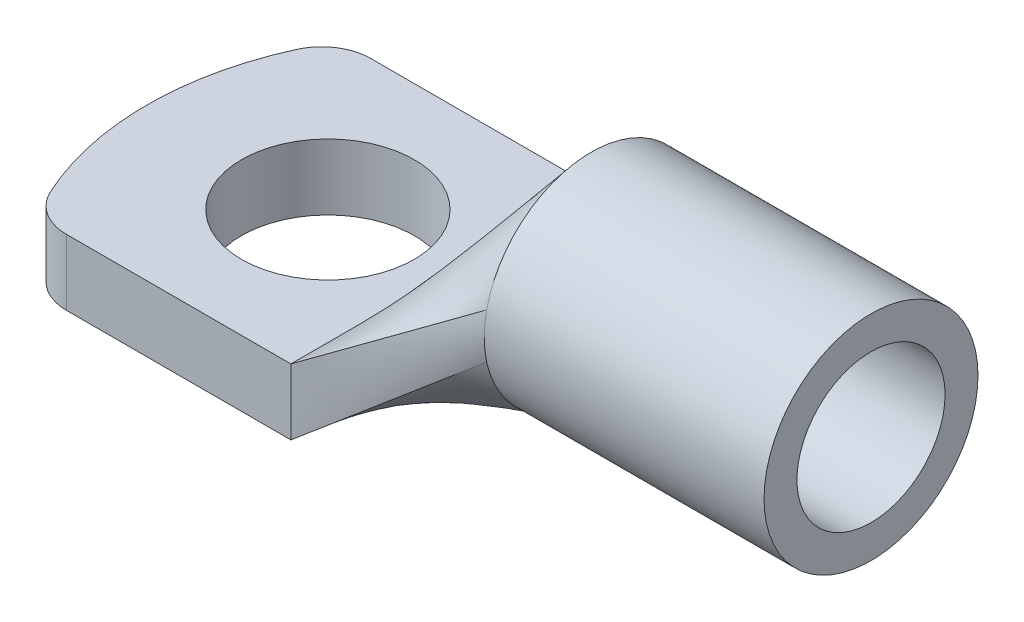
ISO-10303-21;
HEADER;
FILE_DESCRIPTION(('STEP AP214'),'2;1');
FILE_NAME('part.step','',(''),(''),'','','');
FILE_SCHEMA(('AUTOMOTIVE_DESIGN { 1 0 10303 214 1 1 1 1 }'));
ENDSEC;
DATA;
#1=APPLICATION_CONTEXT('core data for automotive mechanical design processes');
#2=APPLICATION_PROTOCOL_DEFINITION('international standard','automotive_design',2000,#1);
#3=PRODUCT_CONTEXT('',#1,'mechanical');
#4=PRODUCT('Part','Part','',(#3));
#5=PRODUCT_RELATED_PRODUCT_CATEGORY('part','',(#4));
#6=PRODUCT_DEFINITION_FORMATION('','',#4);
#7=PRODUCT_DEFINITION_CONTEXT('part definition',#1,'design');
#8=PRODUCT_DEFINITION('design','',#6,#7);
#9=PRODUCT_DEFINITION_SHAPE('','',#8);
#10=(LENGTH_UNIT() NAMED_UNIT(*) SI_UNIT(.MILLI.,.METRE.));
#11=(NAMED_UNIT(*) PLANE_ANGLE_UNIT() SI_UNIT($,.RADIAN.));
#12=(NAMED_UNIT(*) SI_UNIT($,.STERADIAN.) SOLID_ANGLE_UNIT());
#13=UNCERTAINTY_MEASURE_WITH_UNIT(LENGTH_MEASURE(1.E-05),#10,'distance_accuracy_value','');
#14=(GEOMETRIC_REPRESENTATION_CONTEXT(3) GLOBAL_UNCERTAINTY_ASSIGNED_CONTEXT((#13)) GLOBAL_UNIT_ASSIGNED_CONTEXT((#10,
#11,#12)) REPRESENTATION_CONTEXT('',''));
#15=CARTESIAN_POINT('',(0.,0.,0.));
#16=DIRECTION('',(0.,0.,1.));
#17=DIRECTION('',(1.,0.,0.));
#18=AXIS2_PLACEMENT_3D('',#15,#16,#17);
#19=CARTESIAN_POINT('',(0.,4.,-9.25));
#20=DIRECTION('',(0.,0.,-1.));
#21=DIRECTION('',(-1.,0.,0.));
#22=AXIS2_PLACEMENT_3D('',#19,#20,#21);
#23=PLANE('',#22);
#24=DIRECTION('',(1.,0.,0.));
#25=VECTOR('',#24,1.);
#26=CARTESIAN_POINT('',(0.,0.,-9.25));
#27=LINE('',#26,#25);
#28=CARTESIAN_POINT('',(-4.63589014329465,0.,-9.25));
#29=VERTEX_POINT('',#28);
#30=CARTESIAN_POINT('',(9.,0.,-9.25));
#31=VERTEX_POINT('',#30);
#32=EDGE_CURVE('E182',#29,#31,#27,.T.);
#33=ORIENTED_EDGE('',*,*,#32,.F.);
#34=DIRECTION('',(0.,1.,0.));
#35=VECTOR('',#34,1.);
#36=CARTESIAN_POINT('',(-4.63589014329465,4.,-9.25));
#37=LINE('',#36,#35);
#38=CARTESIAN_POINT('',(-4.63589014329465,4.,-9.25));
#39=VERTEX_POINT('',#38);
#40=EDGE_CURVE('E344',#29,#39,#37,.T.);
#41=ORIENTED_EDGE('',*,*,#40,.T.);
#42=DIRECTION('',(1.,0.,0.));
#43=VECTOR('',#42,1.);
#44=CARTESIAN_POINT('',(0.,4.,-9.25));
#45=LINE('',#44,#43);
#46=CARTESIAN_POINT('',(9.,4.,-9.25));
#47=VERTEX_POINT('',#46);
#48=EDGE_CURVE('E189',#39,#47,#45,.T.);
#49=ORIENTED_EDGE('',*,*,#48,.T.);
#50=DIRECTION('',(0.,1.,0.));
#51=VECTOR('',#50,1.);
#52=CARTESIAN_POINT('',(9.,4.,-9.25));
#53=LINE('',#52,#51);
#54=EDGE_CURVE('E195',#47,#31,#53,.F.);
#55=ORIENTED_EDGE('',*,*,#54,.T.);
#56=EDGE_LOOP('',(#33,#41,#49,#55));
#57=FACE_BOUND('',#56,.T.);
#58=ADVANCED_FACE('F84',(#57),#23,.T.);
#59=CARTESIAN_POINT('',(9.,4.,0.));
#60=DIRECTION('',(0.,-1.,0.));
#61=DIRECTION('',(0.,0.,-1.));
#62=AXIS2_PLACEMENT_3D('',#59,#60,#61);
#63=CYLINDRICAL_SURFACE('',#62,18.);
#64=CARTESIAN_POINT('',(9.,4.,0.));
#65=DIRECTION('',(0.,1.,0.));
#66=DIRECTION('',(0.,0.,1.));
#67=AXIS2_PLACEMENT_3D('',#64,#65,#66);
#68=CIRCLE('',#67,18.);
#69=CARTESIAN_POINT('',(-7.36306817195357,4.,-7.5));
#70=VERTEX_POINT('',#69);
#71=CARTESIAN_POINT('',(-7.36306817195357,4.,7.5));
#72=VERTEX_POINT('',#71);
#73=EDGE_CURVE('E188',#70,#72,#68,.T.);
#74=ORIENTED_EDGE('',*,*,#73,.F.);
#75=DIRECTION('',(0.,-1.,0.));
#76=VECTOR('',#75,1.);
#77=CARTESIAN_POINT('',(-7.36306817195358,4.,-7.5));
#78=LINE('',#77,#76);
#79=CARTESIAN_POINT('',(-7.36306817195357,0.,-7.5));
#80=VERTEX_POINT('',#79);
#81=EDGE_CURVE('E167',#70,#80,#78,.T.);
#82=ORIENTED_EDGE('',*,*,#81,.T.);
#83=CARTESIAN_POINT('',(9.,0.,0.));
#84=DIRECTION('',(0.,1.,0.));
#85=DIRECTION('',(0.,0.,1.));
#86=AXIS2_PLACEMENT_3D('',#83,#84,#85);
#87=CIRCLE('',#86,18.);
#88=CARTESIAN_POINT('',(-7.36306817195357,0.,7.5));
#89=VERTEX_POINT('',#88);
#90=EDGE_CURVE('E178',#80,#89,#87,.T.);
#91=ORIENTED_EDGE('',*,*,#90,.T.);
#92=DIRECTION('',(0.,-1.,0.));
#93=VECTOR('',#92,1.);
#94=CARTESIAN_POINT('',(-7.36306817195358,4.,7.5));
#95=LINE('',#94,#93);
#96=EDGE_CURVE('E163',#89,#72,#95,.F.);
#97=ORIENTED_EDGE('',*,*,#96,.T.);
#98=EDGE_LOOP('',(#74,#82,#91,#97));
#99=FACE_BOUND('',#98,.T.);
#100=ADVANCED_FACE('F353',(#99),#63,.T.);
#101=CARTESIAN_POINT('',(0.,4.,9.25));
#102=DIRECTION('',(0.,0.,-1.));
#103=DIRECTION('',(-1.,0.,0.));
#104=AXIS2_PLACEMENT_3D('',#101,#102,#103);
#105=PLANE('',#104);
#106=DIRECTION('',(1.,0.,0.));
#107=VECTOR('',#106,1.);
#108=CARTESIAN_POINT('',(0.,4.,9.25));
#109=LINE('',#108,#107);
#110=CARTESIAN_POINT('',(-4.63589014329465,4.,9.25));
#111=VERTEX_POINT('',#110);
#112=CARTESIAN_POINT('',(9.,4.,9.25));
#113=VERTEX_POINT('',#112);
#114=EDGE_CURVE('E174',#111,#113,#109,.T.);
#115=ORIENTED_EDGE('',*,*,#114,.F.);
#116=DIRECTION('',(0.,-1.,0.));
#117=VECTOR('',#116,1.);
#118=CARTESIAN_POINT('',(-4.63589014329465,4.,9.25));
#119=LINE('',#118,#117);
#120=CARTESIAN_POINT('',(-4.63589014329465,0.,9.25));
#121=VERTEX_POINT('',#120);
#122=EDGE_CURVE('E95',#111,#121,#119,.T.);
#123=ORIENTED_EDGE('',*,*,#122,.T.);
#124=DIRECTION('',(1.,0.,0.));
#125=VECTOR('',#124,1.);
#126=CARTESIAN_POINT('',(0.,0.,9.25));
#127=LINE('',#126,#125);
#128=CARTESIAN_POINT('',(9.,0.,9.25));
#129=VERTEX_POINT('',#128);
#130=EDGE_CURVE('E172',#121,#129,#127,.T.);
#131=ORIENTED_EDGE('',*,*,#130,.T.);
#132=DIRECTION('',(0.,1.,0.));
#133=VECTOR('',#132,1.);
#134=CARTESIAN_POINT('',(9.,4.,9.25));
#135=LINE('',#134,#133);
#136=EDGE_CURVE('E193',#113,#129,#135,.F.);
#137=ORIENTED_EDGE('',*,*,#136,.F.);
#138=EDGE_LOOP('',(#115,#123,#131,#137));
#139=FACE_BOUND('',#138,.T.);
#140=ADVANCED_FACE('F170',(#139),#105,.F.);
#141=CARTESIAN_POINT('',(2.,4.,0.));
#142=DIRECTION('',(0.,-1.,0.));
#143=DIRECTION('',(0.,0.,-1.));
#144=AXIS2_PLACEMENT_3D('',#141,#142,#143);
#145=CYLINDRICAL_SURFACE('',#144,5.25);
#146=CARTESIAN_POINT('',(2.,4.,0.));
#147=DIRECTION('',(0.,1.,0.));
#148=DIRECTION('',(0.,0.,1.));
#149=AXIS2_PLACEMENT_3D('',#146,#147,#148);
#150=CIRCLE('',#149,5.25);
#151=CARTESIAN_POINT('',(2.,4.,5.25000000000001));
#152=VERTEX_POINT('',#151);
#153=EDGE_CURVE('E180',#152,#152,#150,.T.);
#154=ORIENTED_EDGE('',*,*,#153,.T.);
#155=EDGE_LOOP('',(#154));
#156=FACE_BOUND('',#155,.T.);
#157=CARTESIAN_POINT('',(2.,0.,0.));
#158=DIRECTION('',(0.,1.,0.));
#159=DIRECTION('',(0.,0.,1.));
#160=AXIS2_PLACEMENT_3D('',#157,#158,#159);
#161=CIRCLE('',#160,5.25);
#162=CARTESIAN_POINT('',(2.,0.,5.25000000000001));
#163=VERTEX_POINT('',#162);
#164=EDGE_CURVE('E192',#163,#163,#161,.T.);
#165=ORIENTED_EDGE('',*,*,#164,.F.);
#166=EDGE_LOOP('',(#165));
#167=FACE_BOUND('',#166,.T.);
#168=ADVANCED_FACE('F372',(#156,#167),#145,.F.);
#169=CARTESIAN_POINT('',(0.,4.,0.));
#170=DIRECTION('',(0.,1.,0.));
#171=DIRECTION('',(0.,0.,1.));
#172=AXIS2_PLACEMENT_3D('',#169,#170,#171);
#173=PLANE('',#172);
#174=ORIENTED_EDGE('',*,*,#153,.F.);
#175=EDGE_LOOP('',(#174));
#176=FACE_BOUND('',#175,.T.);
#177=ORIENTED_EDGE('',*,*,#48,.F.);
#178=CARTESIAN_POINT('',(-4.63589014329465,4.,-6.25));
#179=DIRECTION('',(0.,1.,0.));
#180=DIRECTION('',(0.,0.,1.));
#181=AXIS2_PLACEMENT_3D('',#178,#179,#180);
#182=CIRCLE('',#181,3.);
#183=EDGE_CURVE('E175',#39,#70,#182,.T.);
#184=ORIENTED_EDGE('',*,*,#183,.T.);
#185=ORIENTED_EDGE('',*,*,#73,.T.);
#186=CARTESIAN_POINT('',(-4.63589014329465,4.,6.25));
#187=DIRECTION('',(0.,1.,0.));
#188=DIRECTION('',(0.,0.,1.));
#189=AXIS2_PLACEMENT_3D('',#186,#187,#188);
#190=CIRCLE('',#189,3.);
#191=EDGE_CURVE('E104',#72,#111,#190,.T.);
#192=ORIENTED_EDGE('',*,*,#191,.T.);
#193=ORIENTED_EDGE('',*,*,#114,.T.);
#194=DIRECTION('',(0.,0.,1.));
#195=VECTOR('',#194,1.);
#196=CARTESIAN_POINT('',(9.,4.,0.));
#197=LINE('',#196,#195);
#198=EDGE_CURVE('E187',#113,#47,#197,.F.);
#199=ORIENTED_EDGE('',*,*,#198,.T.);
#200=EDGE_LOOP('',(#177,#184,#185,#192,#193,#199));
#201=FACE_BOUND('',#200,.T.);
#202=ADVANCED_FACE('F339',(#176,#201),#173,.T.);
#203=CARTESIAN_POINT('',(0.,0.,0.));
#204=DIRECTION('',(0.,1.,0.));
#205=DIRECTION('',(0.,0.,1.));
#206=AXIS2_PLACEMENT_3D('',#203,#204,#205);
#207=PLANE('',#206);
#208=ORIENTED_EDGE('',*,*,#164,.T.);
#209=EDGE_LOOP('',(#208));
#210=FACE_BOUND('',#209,.T.);
#211=ORIENTED_EDGE('',*,*,#90,.F.);
#212=CARTESIAN_POINT('',(-4.63589014329465,0.,-6.25));
#213=DIRECTION('',(0.,1.,0.));
#214=DIRECTION('',(0.,0.,1.));
#215=AXIS2_PLACEMENT_3D('',#212,#213,#214);
#216=CIRCLE('',#215,3.);
#217=EDGE_CURVE('E166',#80,#29,#216,.F.);
#218=ORIENTED_EDGE('',*,*,#217,.T.);
#219=ORIENTED_EDGE('',*,*,#32,.T.);
#220=DIRECTION('',(0.,0.,1.));
#221=VECTOR('',#220,1.);
#222=CARTESIAN_POINT('',(9.,0.,0.));
#223=LINE('',#222,#221);
#224=EDGE_CURVE('E124',#129,#31,#223,.F.);
#225=ORIENTED_EDGE('',*,*,#224,.F.);
#226=ORIENTED_EDGE('',*,*,#130,.F.);
#227=CARTESIAN_POINT('',(-4.63589014329465,0.,6.25));
#228=DIRECTION('',(0.,1.,0.));
#229=DIRECTION('',(0.,0.,1.));
#230=AXIS2_PLACEMENT_3D('',#227,#228,#229);
#231=CIRCLE('',#230,3.);
#232=EDGE_CURVE('E161',#121,#89,#231,.F.);
#233=ORIENTED_EDGE('',*,*,#232,.T.);
#234=EDGE_LOOP('',(#211,#218,#219,#225,#226,#233));
#235=FACE_BOUND('',#234,.T.);
#236=ADVANCED_FACE('F177',(#210,#235),#207,.F.);
#237=CARTESIAN_POINT('',(-4.63589014329465,4.,-6.25));
#238=DIRECTION('',(0.,-1.,0.));
#239=DIRECTION('',(0.,0.,-1.));
#240=AXIS2_PLACEMENT_3D('',#237,#238,#239);
#241=CYLINDRICAL_SURFACE('',#240,3.);
#242=ORIENTED_EDGE('',*,*,#183,.F.);
#243=ORIENTED_EDGE('',*,*,#40,.F.);
#244=ORIENTED_EDGE('',*,*,#217,.F.);
#245=ORIENTED_EDGE('',*,*,#81,.F.);
#246=EDGE_LOOP('',(#242,#243,#244,#245));
#247=FACE_BOUND('',#246,.T.);
#248=ADVANCED_FACE('F354',(#247),#241,.T.);
#249=CARTESIAN_POINT('',(-4.63589014329465,4.,6.25));
#250=DIRECTION('',(0.,-1.,0.));
#251=DIRECTION('',(0.,0.,-1.));
#252=AXIS2_PLACEMENT_3D('',#249,#250,#251);
#253=CYLINDRICAL_SURFACE('',#252,3.);
#254=ORIENTED_EDGE('',*,*,#191,.F.);
#255=ORIENTED_EDGE('',*,*,#96,.F.);
#256=ORIENTED_EDGE('',*,*,#232,.F.);
#257=ORIENTED_EDGE('',*,*,#122,.F.);
#258=EDGE_LOOP('',(#254,#255,#256,#257));
#259=FACE_BOUND('',#258,.T.);
#260=ADVANCED_FACE('F86',(#259),#253,.T.);
#261=CARTESIAN_POINT('',(9.,0.,-9.25));
#262=CARTESIAN_POINT('',(18.,7.145621458571,-6.35319207535914));
#263=CARTESIAN_POINT('',(9.,0.666666666666667,-9.25));
#264=CARTESIAN_POINT('',(18.,7.59316739948749,-6.44995876528703));
#265=CARTESIAN_POINT('',(9.,1.33333333333333,-9.25));
#266=CARTESIAN_POINT('',(18.,8.05616694335666,-6.5));
#267=CARTESIAN_POINT('',(9.,2.66666666666667,-9.25));
#268=CARTESIAN_POINT('',(18.,8.98240227664334,-6.5));
#269=CARTESIAN_POINT('',(9.,3.33333333333333,-9.25));
#270=CARTESIAN_POINT('',(18.,9.44540182051252,-6.44995876528703));
#271=CARTESIAN_POINT('',(9.,4.,-9.25));
#272=CARTESIAN_POINT('',(18.,9.89294776142901,-6.35319207535914));
#273=B_SPLINE_SURFACE_WITH_KNOTS('',3,1,((#261,#262),(#263,#264),(#265,#266),(#267,#268),(#269,
#270),(#271,#272)),.UNSPECIFIED.,.F.,.F.,.F.,(4,2,4),(2,2),(0.,0.5,1.),(0.,1.),.UNSPECIFIED.);
#274=DIRECTION('',(0.807838503036537,0.528950010896146,0.260016997491805));
#275=VECTOR('',#274,1.);
#276=CARTESIAN_POINT('',(13.5,6.9464738807145,-7.80159603767957));
#277=LINE('',#276,#275);
#278=CARTESIAN_POINT('',(18.,9.89307986731626,-6.35380128540032));
#279=VERTEX_POINT('',#278);
#280=EDGE_CURVE('E326',#47,#279,#277,.T.);
#281=CARTESIAN_POINT('',(18.,8.51928461,0.));
#282=DIRECTION('',(1.,0.,0.));
#283=DIRECTION('',(0.,0.,-1.));
#284=AXIS2_PLACEMENT_3D('',#281,#282,#283);
#285=CIRCLE('',#284,6.5);
#286=CARTESIAN_POINT('',(18.,7.14549797734405,-6.35376124732742));
#287=VERTEX_POINT('',#286);
#288=EDGE_CURVE('E88',#287,#279,#285,.T.);
#289=DIRECTION('',(-0.759415522313199,-0.602943983579233,-0.244431211459128));
#290=VECTOR('',#289,1.);
#291=CARTESIAN_POINT('',(13.5,3.5728107292855,-7.80159603767957));
#292=LINE('',#291,#290);
#293=EDGE_CURVE('E323',#287,#31,#292,.T.);
#294=ORIENTED_EDGE('',*,*,#54,.F.);
#295=ORIENTED_EDGE('',*,*,#280,.T.);
#296=ORIENTED_EDGE('',*,*,#288,.F.);
#297=ORIENTED_EDGE('',*,*,#293,.T.);
#298=EDGE_LOOP('',(#294,#295,#296,#297));
#299=FACE_BOUND('',#298,.T.);
#300=ADVANCED_FACE('F252',(#299),#273,.T.);
#301=CARTESIAN_POINT('',(9.,4.,-9.25));
#302=CARTESIAN_POINT('',(18.,9.892947761429,-6.35319207535914));
#303=CARTESIAN_POINT('',(9.,4.,-8.47916666666666));
#304=CARTESIAN_POINT('',(18.,10.4104227556137,-6.24130559013001));
#305=CARTESIAN_POINT('',(9.,4.,-7.70833333333333));
#306=CARTESIAN_POINT('',(18.,10.9677174700676,-6.05512497589111));
#307=CARTESIAN_POINT('',(9.,4.,-6.16666666666666));
#308=CARTESIAN_POINT('',(18.,12.1013351609206,-5.46152687392169));
#309=CARTESIAN_POINT('',(9.,4.,-5.39583333333333));
#310=CARTESIAN_POINT('',(18.,12.6778161259908,-5.05190768004299));
#311=CARTESIAN_POINT('',(9.,4.,-4.23958333333333));
#312=CARTESIAN_POINT('',(18.,13.4603392328366,-4.23996086166335));
#313=CARTESIAN_POINT('',(9.,4.,-3.85416666666666));
#314=CARTESIAN_POINT('',(18.,13.7068864246582,-3.93689122231742));
#315=CARTESIAN_POINT('',(9.,4.,-3.08333333333333));
#316=CARTESIAN_POINT('',(18.,14.1508635798117,-3.27041945177983));
#317=CARTESIAN_POINT('',(9.,4.,-2.69791666666666));
#318=CARTESIAN_POINT('',(18.,14.3481588267121,-2.90699254098453));
#319=CARTESIAN_POINT('',(9.,4.,-1.92708333333332));
#320=CARTESIAN_POINT('',(18.,14.6737839361115,-2.13272555957954));
#321=CARTESIAN_POINT('',(9.,4.,-1.54166666666666));
#322=CARTESIAN_POINT('',(18.,14.8019676129627,-1.72194455615372));
#323=CARTESIAN_POINT('',(9.,4.,-0.770833333333324));
#324=CARTESIAN_POINT('',(18.,14.9747664777475,-0.874043834923259));
#325=CARTESIAN_POINT('',(9.,4.,-0.385416666666657));
#326=CARTESIAN_POINT('',(18.,15.01928461,-0.437066243242613));
#327=CARTESIAN_POINT('',(9.,4.,0.385416666666677));
#328=CARTESIAN_POINT('',(18.,15.01928461,0.437066243242612));
#329=CARTESIAN_POINT('',(9.,4.,0.770833333333344));
#330=CARTESIAN_POINT('',(18.,14.9747664777474,0.87404383492326));
#331=CARTESIAN_POINT('',(9.,4.,1.54166666666668));
#332=CARTESIAN_POINT('',(18.,14.8019676129627,1.72194455615372));
#333=CARTESIAN_POINT('',(9.,4.,1.92708333333334));
#334=CARTESIAN_POINT('',(18.,14.6737839361115,2.13272555957954));
#335=CARTESIAN_POINT('',(9.,4.,2.69791666666668));
#336=CARTESIAN_POINT('',(18.,14.3481588267121,2.90699254098453));
#337=CARTESIAN_POINT('',(9.,4.,3.08333333333334));
#338=CARTESIAN_POINT('',(18.,14.1508635798117,3.27041945177983));
#339=CARTESIAN_POINT('',(9.,4.,3.85416666666668));
#340=CARTESIAN_POINT('',(18.,13.7068864246582,3.93689122231742));
#341=CARTESIAN_POINT('',(9.,4.,4.23958333333334));
#342=CARTESIAN_POINT('',(18.,13.4603392328366,4.23996086166335));
#343=CARTESIAN_POINT('',(9.,4.,5.39583333333334));
#344=CARTESIAN_POINT('',(18.,12.6778161259908,5.05190768004299));
#345=CARTESIAN_POINT('',(9.,4.,6.16666666666667));
#346=CARTESIAN_POINT('',(18.,12.1013351609206,5.46152687392169));
#347=CARTESIAN_POINT('',(9.,4.,7.70833333333334));
#348=CARTESIAN_POINT('',(18.,10.9677174700676,6.05512497589111));
#349=CARTESIAN_POINT('',(9.,4.,8.47916666666667));
#350=CARTESIAN_POINT('',(18.,10.4104227556137,6.24130559013002));
#351=CARTESIAN_POINT('',(9.,4.,9.25));
#352=CARTESIAN_POINT('',(18.,9.892947761429,6.35319207535914));
#353=B_SPLINE_SURFACE_WITH_KNOTS('',3,1,((#301,#302),(#303,#304),(#305,#306),(#307,#308),(#309,
#310),(#311,#312),(#313,#314),(#315,#316),(#317,#318),(#319,#320),(#321,#322),(#323,#324),(#325,
#326),(#327,#328),(#329,#330),(#331,#332),(#333,#334),(#335,#336),(#337,#338),(#339,#340),(#341,
#342),(#343,#344),(#345,#346),(#347,#348),(#349,#350),(#351,#352)),.UNSPECIFIED.,.F.,.F.,.F.,(4,
2,2,2,2,2,2,2,2,2,2,2,4),(2,2),(0.,0.125,0.25,0.3125,0.375,0.4375,0.5,0.5625,0.625,0.6875,0.75,
0.875,1.),(0.,1.),.UNSPECIFIED.);
#354=DIRECTION('',(0.807838503036537,0.528950010896146,-0.260016997491806));
#355=VECTOR('',#354,1.);
#356=CARTESIAN_POINT('',(13.5,6.9464738807145,7.80159603767957));
#357=LINE('',#356,#355);
#358=CARTESIAN_POINT('',(18.,9.89307493984266,6.35377809382672));
#359=VERTEX_POINT('',#358);
#360=EDGE_CURVE('E330',#113,#359,#357,.T.);
#361=EDGE_CURVE('E203',#279,#359,#285,.T.);
#362=ORIENTED_EDGE('',*,*,#198,.F.);
#363=ORIENTED_EDGE('',*,*,#360,.T.);
#364=ORIENTED_EDGE('',*,*,#361,.F.);
#365=ORIENTED_EDGE('',*,*,#280,.F.);
#366=EDGE_LOOP('',(#362,#363,#364,#365));
#367=FACE_BOUND('',#366,.T.);
#368=ADVANCED_FACE('F257',(#367),#353,.T.);
#369=CARTESIAN_POINT('',(9.,0.,9.25));
#370=CARTESIAN_POINT('',(18.,7.145621458571,6.35319207535914));
#371=CARTESIAN_POINT('',(9.,0.,8.47916666666667));
#372=CARTESIAN_POINT('',(18.,6.62814646438631,6.24130559013002));
#373=CARTESIAN_POINT('',(9.,0.,7.70833333333334));
#374=CARTESIAN_POINT('',(18.,6.0708517499324,6.05512497589111));
#375=CARTESIAN_POINT('',(9.,0.,6.16666666666667));
#376=CARTESIAN_POINT('',(18.,4.93723405907944,5.46152687392169));
#377=CARTESIAN_POINT('',(9.,0.,5.39583333333334));
#378=CARTESIAN_POINT('',(18.,4.36075309400917,5.051907680043));
#379=CARTESIAN_POINT('',(9.,0.,4.23958333333334));
#380=CARTESIAN_POINT('',(18.,3.57822998716344,4.23996086166336));
#381=CARTESIAN_POINT('',(9.,0.,3.85416666666667));
#382=CARTESIAN_POINT('',(18.,3.33168279534176,3.93689122231742));
#383=CARTESIAN_POINT('',(9.,0.,3.08333333333334));
#384=CARTESIAN_POINT('',(18.,2.88770564018829,3.27041945177983));
#385=CARTESIAN_POINT('',(9.,0.,2.69791666666668));
#386=CARTESIAN_POINT('',(18.,2.69041039328786,2.90699254098454));
#387=CARTESIAN_POINT('',(9.,0.,1.92708333333334));
#388=CARTESIAN_POINT('',(18.,2.36478528388845,2.13272555957955));
#389=CARTESIAN_POINT('',(9.,0.,1.54166666666668));
#390=CARTESIAN_POINT('',(18.,2.23660160703733,1.72194455615373));
#391=CARTESIAN_POINT('',(9.,0.,0.770833333333344));
#392=CARTESIAN_POINT('',(18.,2.06380274225255,0.874043834923261));
#393=CARTESIAN_POINT('',(9.,0.,0.385416666666677));
#394=CARTESIAN_POINT('',(18.,2.01928461,0.437066243242615));
#395=CARTESIAN_POINT('',(9.,0.,-0.385416666666656));
#396=CARTESIAN_POINT('',(18.,2.01928461,-0.437066243242611));
#397=CARTESIAN_POINT('',(9.,0.,-0.770833333333321));
#398=CARTESIAN_POINT('',(18.,2.06380274225255,-0.874043834923258));
#399=CARTESIAN_POINT('',(9.,0.,-1.54166666666665));
#400=CARTESIAN_POINT('',(18.,2.23660160703733,-1.72194455615372));
#401=CARTESIAN_POINT('',(9.,0.,-1.92708333333332));
#402=CARTESIAN_POINT('',(18.,2.36478528388845,-2.13272555957954));
#403=CARTESIAN_POINT('',(9.,0.,-2.69791666666665));
#404=CARTESIAN_POINT('',(18.,2.69041039328785,-2.90699254098453));
#405=CARTESIAN_POINT('',(9.,0.,-3.08333333333332));
#406=CARTESIAN_POINT('',(18.,2.88770564018829,-3.27041945177983));
#407=CARTESIAN_POINT('',(9.,0.,-3.85416666666665));
#408=CARTESIAN_POINT('',(18.,3.33168279534176,-3.93689122231742));
#409=CARTESIAN_POINT('',(9.,0.,-4.23958333333332));
#410=CARTESIAN_POINT('',(18.,3.57822998716344,-4.23996086166336));
#411=CARTESIAN_POINT('',(9.,0.,-5.39583333333332));
#412=CARTESIAN_POINT('',(18.,4.36075309400917,-5.05190768004299));
#413=CARTESIAN_POINT('',(9.,0.,-6.16666666666666));
#414=CARTESIAN_POINT('',(18.,4.93723405907943,-5.46152687392169));
#415=CARTESIAN_POINT('',(9.,0.,-7.70833333333333));
#416=CARTESIAN_POINT('',(18.,6.0708517499324,-6.05512497589111));
#417=CARTESIAN_POINT('',(9.,0.,-8.47916666666666));
#418=CARTESIAN_POINT('',(18.,6.6281464643863,-6.24130559013002));
#419=CARTESIAN_POINT('',(9.,0.,-9.25));
#420=CARTESIAN_POINT('',(18.,7.145621458571,-6.35319207535914));
#421=B_SPLINE_SURFACE_WITH_KNOTS('',3,1,((#369,#370),(#371,#372),(#373,#374),(#375,#376),(#377,
#378),(#379,#380),(#381,#382),(#383,#384),(#385,#386),(#387,#388),(#389,#390),(#391,#392),(#393,
#394),(#395,#396),(#397,#398),(#399,#400),(#401,#402),(#403,#404),(#405,#406),(#407,#408),(#409,
#410),(#411,#412),(#413,#414),(#415,#416),(#417,#418),(#419,#420)),.UNSPECIFIED.,.F.,.F.,.F.,(4,
2,2,2,2,2,2,2,2,2,2,2,4),(2,2),(0.,0.125,0.25,0.3125,0.375,0.4375,0.5,0.5625,0.625,0.6875,0.75,
0.875,1.),(0.,1.),.UNSPECIFIED.);
#422=CARTESIAN_POINT('',(18.,7.1454930575139,6.35378439801342));
#423=VERTEX_POINT('',#422);
#424=EDGE_CURVE('E135',#423,#287,#285,.T.);
#425=DIRECTION('',(0.759415522313199,0.602943983579233,-0.244431211459128));
#426=VECTOR('',#425,1.);
#427=CARTESIAN_POINT('',(13.5,3.5728107292855,7.80159603767957));
#428=LINE('',#427,#426);
#429=EDGE_CURVE('E204',#129,#423,#428,.T.);
#430=ORIENTED_EDGE('',*,*,#224,.T.);
#431=ORIENTED_EDGE('',*,*,#293,.F.);
#432=ORIENTED_EDGE('',*,*,#424,.F.);
#433=ORIENTED_EDGE('',*,*,#429,.F.);
#434=EDGE_LOOP('',(#430,#431,#432,#433));
#435=FACE_BOUND('',#434,.T.);
#436=ADVANCED_FACE('F281',(#435),#421,.T.);
#437=CARTESIAN_POINT('',(9.,4.,9.25));
#438=CARTESIAN_POINT('',(18.,9.892947761429,6.35319207535914));
#439=CARTESIAN_POINT('',(9.,3.33333333333333,9.25));
#440=CARTESIAN_POINT('',(18.,9.44540182051251,6.44995876528703));
#441=CARTESIAN_POINT('',(9.,2.66666666666666,9.25));
#442=CARTESIAN_POINT('',(18.,8.98240227664334,6.5));
#443=CARTESIAN_POINT('',(9.,1.33333333333333,9.25));
#444=CARTESIAN_POINT('',(18.,8.05616694335666,6.5));
#445=CARTESIAN_POINT('',(9.,0.666666666666664,9.25));
#446=CARTESIAN_POINT('',(18.,7.59316739948749,6.44995876528703));
#447=CARTESIAN_POINT('',(9.,0.,9.25));
#448=CARTESIAN_POINT('',(18.,7.145621458571,6.35319207535914));
#449=B_SPLINE_SURFACE_WITH_KNOTS('',3,1,((#437,#438),(#439,#440),(#441,#442),(#443,#444),(#445,
#446),(#447,#448)),.UNSPECIFIED.,.F.,.F.,.F.,(4,2,4),(2,2),(0.,0.5,1.),(0.,1.),.UNSPECIFIED.);
#450=EDGE_CURVE('E200',#359,#423,#285,.T.);
#451=ORIENTED_EDGE('',*,*,#136,.T.);
#452=ORIENTED_EDGE('',*,*,#429,.T.);
#453=ORIENTED_EDGE('',*,*,#450,.F.);
#454=ORIENTED_EDGE('',*,*,#360,.F.);
#455=EDGE_LOOP('',(#451,#452,#453,#454));
#456=FACE_BOUND('',#455,.T.);
#457=ADVANCED_FACE('F292',(#456),#449,.T.);
#458=CARTESIAN_POINT('',(35.,8.51928461,0.));
#459=DIRECTION('',(1.,0.,0.));
#460=DIRECTION('',(0.,0.,-1.));
#461=AXIS2_PLACEMENT_3D('',#458,#459,#460);
#462=PLANE('',#461);
#463=CARTESIAN_POINT('',(35.,8.51928461,0.));
#464=DIRECTION('',(1.,0.,0.));
#465=DIRECTION('',(0.,0.,-1.));
#466=AXIS2_PLACEMENT_3D('',#463,#464,#465);
#467=CIRCLE('',#466,6.5);
#468=CARTESIAN_POINT('',(35.,8.51928461,-6.5));
#469=VERTEX_POINT('',#468);
#470=EDGE_CURVE('E232',#469,#469,#467,.T.);
#471=ORIENTED_EDGE('',*,*,#470,.T.);
#472=EDGE_LOOP('',(#471));
#473=FACE_BOUND('',#472,.T.);
#474=CARTESIAN_POINT('',(35.,8.51928461,0.));
#475=DIRECTION('',(1.,0.,0.));
#476=DIRECTION('',(0.,0.,-1.));
#477=AXIS2_PLACEMENT_3D('',#474,#475,#476);
#478=CIRCLE('',#477,4.5);
#479=CARTESIAN_POINT('',(35.,8.51928461,-4.5));
#480=VERTEX_POINT('',#479);
#481=EDGE_CURVE('E475',#480,#480,#478,.T.);
#482=ORIENTED_EDGE('',*,*,#481,.F.);
#483=EDGE_LOOP('',(#482));
#484=FACE_BOUND('',#483,.T.);
#485=ADVANCED_FACE('F249',(#473,#484),#462,.T.);
#486=CARTESIAN_POINT('',(35.,8.51928461,0.));
#487=DIRECTION('',(-1.,0.,0.));
#488=DIRECTION('',(0.,0.,1.));
#489=AXIS2_PLACEMENT_3D('',#486,#487,#488);
#490=CYLINDRICAL_SURFACE('',#489,6.5);
#491=ORIENTED_EDGE('',*,*,#470,.F.);
#492=EDGE_LOOP('',(#491));
#493=FACE_BOUND('',#492,.T.);
#494=ORIENTED_EDGE('',*,*,#361,.T.);
#495=ORIENTED_EDGE('',*,*,#450,.T.);
#496=ORIENTED_EDGE('',*,*,#424,.T.);
#497=ORIENTED_EDGE('',*,*,#288,.T.);
#498=EDGE_LOOP('',(#494,#495,#496,#497));
#499=FACE_BOUND('',#498,.T.);
#500=ADVANCED_FACE('F224',(#493,#499),#490,.T.);
#501=CARTESIAN_POINT('',(35.,8.51928461,0.));
#502=DIRECTION('',(-1.,0.,0.));
#503=DIRECTION('',(0.,0.,1.));
#504=AXIS2_PLACEMENT_3D('',#501,#502,#503);
#505=CYLINDRICAL_SURFACE('',#504,4.5);
#506=ORIENTED_EDGE('',*,*,#481,.T.);
#507=EDGE_LOOP('',(#506));
#508=FACE_BOUND('',#507,.T.);
#509=CARTESIAN_POINT('',(18.,8.51928461,0.));
#510=DIRECTION('',(1.,0.,0.));
#511=DIRECTION('',(0.,0.,-1.));
#512=AXIS2_PLACEMENT_3D('',#509,#510,#511);
#513=CIRCLE('',#512,4.5);
#514=CARTESIAN_POINT('',(18.,8.51928461,-4.5));
#515=VERTEX_POINT('',#514);
#516=EDGE_CURVE('E14',#515,#515,#513,.F.);
#517=ORIENTED_EDGE('',*,*,#516,.T.);
#518=EDGE_LOOP('',(#517));
#519=FACE_BOUND('',#518,.T.);
#520=ADVANCED_FACE('F248',(#508,#519),#505,.F.);
#521=CARTESIAN_POINT('',(18.,8.51928461,0.));
#522=DIRECTION('',(1.,0.,0.));
#523=DIRECTION('',(0.,0.,-1.));
#524=AXIS2_PLACEMENT_3D('',#521,#522,#523);
#525=PLANE('',#524);
#526=ORIENTED_EDGE('',*,*,#516,.F.);
#527=EDGE_LOOP('',(#526));
#528=FACE_BOUND('',#527,.T.);
#529=ADVANCED_FACE('F304',(#528),#525,.T.);
#530=CLOSED_SHELL('',(#58,#100,#140,#168,#202,#236,#248,#260,#300,#368,#436,#457,#485,#500,#520,#529));
#531=MANIFOLD_SOLID_BREP('B2',#530);
#532=ADVANCED_BREP_SHAPE_REPRESENTATION('',(#18,#531),#14);
#533=SHAPE_DEFINITION_REPRESENTATION(#9,#532);
ENDSEC;
END-ISO-10303-21;
